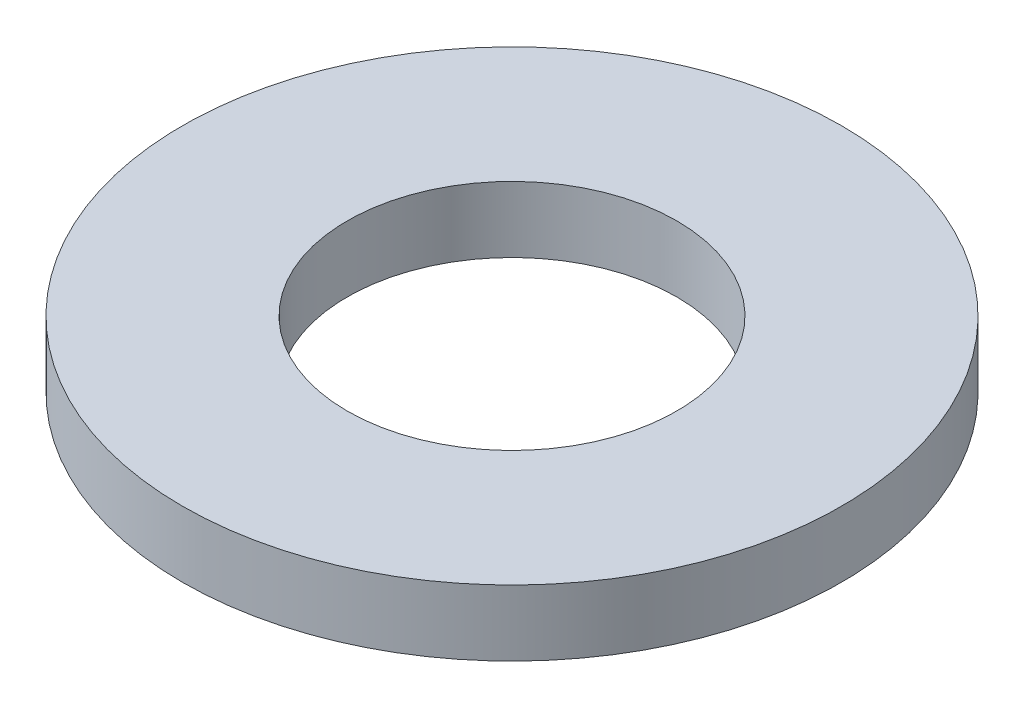
ISO-10303-21;
HEADER;
FILE_DESCRIPTION(('STEP AP214'),'2;1');
FILE_NAME('part.step','',(''),(''),'','','');
FILE_SCHEMA(('AUTOMOTIVE_DESIGN { 1 0 10303 214 1 1 1 1 }'));
ENDSEC;
DATA;
#1=APPLICATION_CONTEXT('core data for automotive mechanical design processes');
#2=APPLICATION_PROTOCOL_DEFINITION('international standard','automotive_design',2000,#1);
#3=PRODUCT_CONTEXT('',#1,'mechanical');
#4=PRODUCT('Part','Part','',(#3));
#5=PRODUCT_RELATED_PRODUCT_CATEGORY('part','',(#4));
#6=PRODUCT_DEFINITION_FORMATION('','',#4);
#7=PRODUCT_DEFINITION_CONTEXT('part definition',#1,'design');
#8=PRODUCT_DEFINITION('design','',#6,#7);
#9=PRODUCT_DEFINITION_SHAPE('','',#8);
#10=(LENGTH_UNIT() NAMED_UNIT(*) SI_UNIT(.MILLI.,.METRE.));
#11=(NAMED_UNIT(*) PLANE_ANGLE_UNIT() SI_UNIT($,.RADIAN.));
#12=(NAMED_UNIT(*) SI_UNIT($,.STERADIAN.) SOLID_ANGLE_UNIT());
#13=UNCERTAINTY_MEASURE_WITH_UNIT(LENGTH_MEASURE(1.E-05),#10,'distance_accuracy_value','');
#14=(GEOMETRIC_REPRESENTATION_CONTEXT(3) GLOBAL_UNCERTAINTY_ASSIGNED_CONTEXT((#13)) GLOBAL_UNIT_ASSIGNED_CONTEXT((#10,
#11,#12)) REPRESENTATION_CONTEXT('',''));
#15=CARTESIAN_POINT('',(0.,0.,0.));
#16=DIRECTION('',(0.,0.,1.));
#17=DIRECTION('',(1.,0.,0.));
#18=AXIS2_PLACEMENT_3D('',#15,#16,#17);
#19=CARTESIAN_POINT('',(0.,0.8,0.));
#20=DIRECTION('',(0.,1.,0.));
#21=DIRECTION('',(0.,0.,1.));
#22=AXIS2_PLACEMENT_3D('',#19,#20,#21);
#23=PLANE('',#22);
#24=CARTESIAN_POINT('',(0.,0.8,0.));
#25=DIRECTION('',(0.,1.,0.));
#26=DIRECTION('',(0.,0.,1.));
#27=AXIS2_PLACEMENT_3D('',#24,#25,#26);
#28=CIRCLE('',#27,4.);
#29=CARTESIAN_POINT('',(0.,0.8,4.));
#30=VERTEX_POINT('',#29);
#31=EDGE_CURVE('E10',#30,#30,#28,.T.);
#32=ORIENTED_EDGE('',*,*,#31,.T.);
#33=EDGE_LOOP('',(#32));
#34=FACE_BOUND('',#33,.T.);
#35=CARTESIAN_POINT('',(0.,0.8,0.));
#36=DIRECTION('',(0.,1.,0.));
#37=DIRECTION('',(0.,0.,1.));
#38=AXIS2_PLACEMENT_3D('',#35,#36,#37);
#39=CIRCLE('',#38,2.);
#40=CARTESIAN_POINT('',(0.,0.8,2.));
#41=VERTEX_POINT('',#40);
#42=EDGE_CURVE('E26',#41,#41,#39,.T.);
#43=ORIENTED_EDGE('',*,*,#42,.F.);
#44=EDGE_LOOP('',(#43));
#45=FACE_BOUND('',#44,.T.);
#46=ADVANCED_FACE('F15',(#34,#45),#23,.T.);
#47=CARTESIAN_POINT('',(0.,0.,0.));
#48=DIRECTION('',(0.,1.,0.));
#49=DIRECTION('',(0.,0.,1.));
#50=AXIS2_PLACEMENT_3D('',#47,#48,#49);
#51=PLANE('',#50);
#52=CARTESIAN_POINT('',(0.,0.,0.));
#53=DIRECTION('',(0.,1.,0.));
#54=DIRECTION('',(0.,0.,1.));
#55=AXIS2_PLACEMENT_3D('',#52,#53,#54);
#56=CIRCLE('',#55,4.);
#57=CARTESIAN_POINT('',(0.,0.,4.));
#58=VERTEX_POINT('',#57);
#59=EDGE_CURVE('E19',#58,#58,#56,.T.);
#60=ORIENTED_EDGE('',*,*,#59,.F.);
#61=EDGE_LOOP('',(#60));
#62=FACE_BOUND('',#61,.T.);
#63=CARTESIAN_POINT('',(0.,0.,0.));
#64=DIRECTION('',(0.,1.,0.));
#65=DIRECTION('',(0.,0.,1.));
#66=AXIS2_PLACEMENT_3D('',#63,#64,#65);
#67=CIRCLE('',#66,2.);
#68=CARTESIAN_POINT('',(0.,0.,2.));
#69=VERTEX_POINT('',#68);
#70=EDGE_CURVE('E28',#69,#69,#67,.T.);
#71=ORIENTED_EDGE('',*,*,#70,.T.);
#72=EDGE_LOOP('',(#71));
#73=FACE_BOUND('',#72,.T.);
#74=ADVANCED_FACE('F38',(#62,#73),#51,.F.);
#75=CARTESIAN_POINT('',(0.,0.8,0.));
#76=DIRECTION('',(0.,-1.,0.));
#77=DIRECTION('',(0.,0.,-1.));
#78=AXIS2_PLACEMENT_3D('',#75,#76,#77);
#79=CYLINDRICAL_SURFACE('',#78,4.);
#80=ORIENTED_EDGE('',*,*,#31,.F.);
#81=EDGE_LOOP('',(#80));
#82=FACE_BOUND('',#81,.T.);
#83=ORIENTED_EDGE('',*,*,#59,.T.);
#84=EDGE_LOOP('',(#83));
#85=FACE_BOUND('',#84,.T.);
#86=ADVANCED_FACE('F17',(#82,#85),#79,.T.);
#87=CARTESIAN_POINT('',(0.,0.8,0.));
#88=DIRECTION('',(0.,-1.,0.));
#89=DIRECTION('',(0.,0.,-1.));
#90=AXIS2_PLACEMENT_3D('',#87,#88,#89);
#91=CYLINDRICAL_SURFACE('',#90,2.);
#92=ORIENTED_EDGE('',*,*,#42,.T.);
#93=EDGE_LOOP('',(#92));
#94=FACE_BOUND('',#93,.T.);
#95=ORIENTED_EDGE('',*,*,#70,.F.);
#96=EDGE_LOOP('',(#95));
#97=FACE_BOUND('',#96,.T.);
#98=ADVANCED_FACE('F34',(#94,#97),#91,.F.);
#99=CLOSED_SHELL('',(#46,#74,#86,#98));
#100=MANIFOLD_SOLID_BREP('B1',#99);
#101=ADVANCED_BREP_SHAPE_REPRESENTATION('',(#18,#100),#14);
#102=SHAPE_DEFINITION_REPRESENTATION(#9,#101);
ENDSEC;
END-ISO-10303-21;
